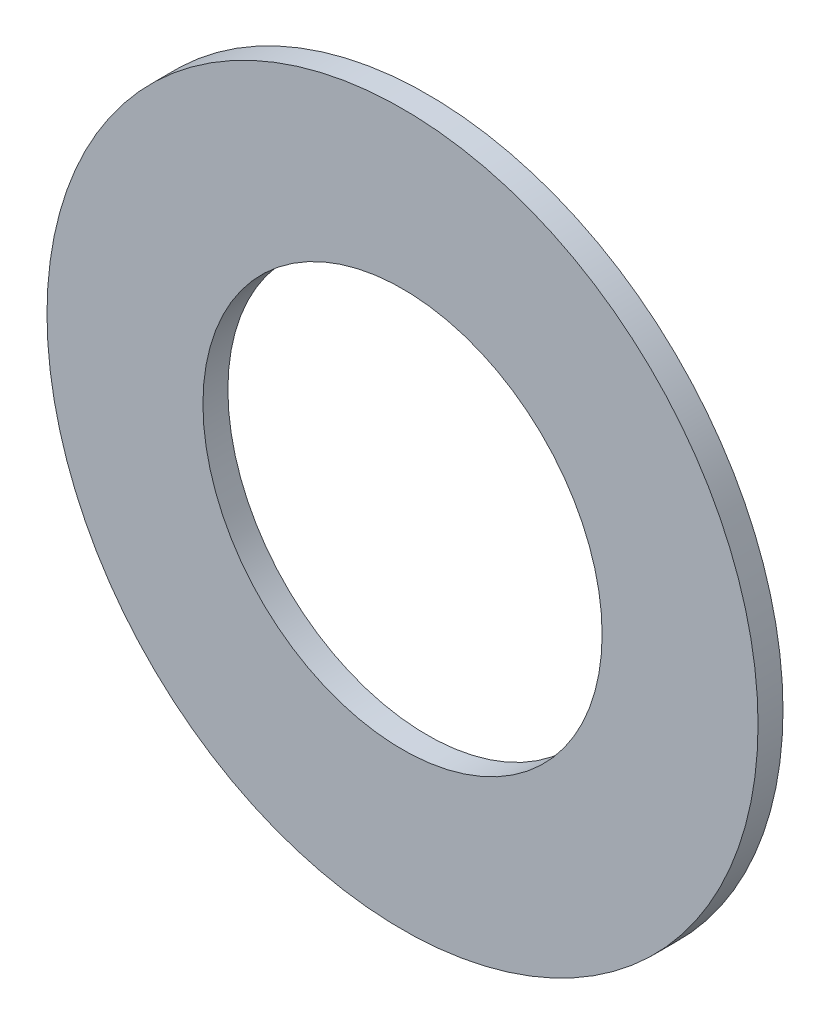
ISO-10303-21;
HEADER;
FILE_DESCRIPTION(('STEP AP214'),'2;1');
FILE_NAME('part.step','',(''),(''),'','','');
FILE_SCHEMA(('AUTOMOTIVE_DESIGN { 1 0 10303 214 1 1 1 1 }'));
ENDSEC;
DATA;
#1=APPLICATION_CONTEXT('core data for automotive mechanical design processes');
#2=APPLICATION_PROTOCOL_DEFINITION('international standard','automotive_design',2000,#1);
#3=PRODUCT_CONTEXT('',#1,'mechanical');
#4=PRODUCT('Part','Part','',(#3));
#5=PRODUCT_RELATED_PRODUCT_CATEGORY('part','',(#4));
#6=PRODUCT_DEFINITION_FORMATION('','',#4);
#7=PRODUCT_DEFINITION_CONTEXT('part definition',#1,'design');
#8=PRODUCT_DEFINITION('design','',#6,#7);
#9=PRODUCT_DEFINITION_SHAPE('','',#8);
#10=(LENGTH_UNIT() NAMED_UNIT(*) SI_UNIT(.MILLI.,.METRE.));
#11=(NAMED_UNIT(*) PLANE_ANGLE_UNIT() SI_UNIT($,.RADIAN.));
#12=(NAMED_UNIT(*) SI_UNIT($,.STERADIAN.) SOLID_ANGLE_UNIT());
#13=UNCERTAINTY_MEASURE_WITH_UNIT(LENGTH_MEASURE(1.E-05),#10,'distance_accuracy_value','');
#14=(GEOMETRIC_REPRESENTATION_CONTEXT(3) GLOBAL_UNCERTAINTY_ASSIGNED_CONTEXT((#13)) GLOBAL_UNIT_ASSIGNED_CONTEXT((#10,
#11,#12)) REPRESENTATION_CONTEXT('',''));
#15=CARTESIAN_POINT('',(0.,0.,0.));
#16=DIRECTION('',(0.,0.,1.));
#17=DIRECTION('',(1.,0.,0.));
#18=AXIS2_PLACEMENT_3D('',#15,#16,#17);
#19=CARTESIAN_POINT('',(0.,0.,-0.508));
#20=DIRECTION('',(0.,0.,1.));
#21=DIRECTION('',(1.,0.,0.));
#22=AXIS2_PLACEMENT_3D('',#19,#20,#21);
#23=CYLINDRICAL_SURFACE('',#22,7.239);
#24=CARTESIAN_POINT('',(0.,0.,-0.508));
#25=DIRECTION('',(0.,0.,1.));
#26=DIRECTION('',(1.,0.,0.));
#27=AXIS2_PLACEMENT_3D('',#24,#25,#26);
#28=CIRCLE('',#27,7.239);
#29=CARTESIAN_POINT('',(7.239,0.,-0.508));
#30=VERTEX_POINT('',#29);
#31=EDGE_CURVE('E10',#30,#30,#28,.T.);
#32=ORIENTED_EDGE('',*,*,#31,.T.);
#33=EDGE_LOOP('',(#32));
#34=FACE_BOUND('',#33,.T.);
#35=CARTESIAN_POINT('',(0.,0.,0.));
#36=DIRECTION('',(0.,0.,1.));
#37=DIRECTION('',(1.,0.,0.));
#38=AXIS2_PLACEMENT_3D('',#35,#36,#37);
#39=CIRCLE('',#38,7.239);
#40=CARTESIAN_POINT('',(7.239,0.,0.));
#41=VERTEX_POINT('',#40);
#42=EDGE_CURVE('E33',#41,#41,#39,.T.);
#43=ORIENTED_EDGE('',*,*,#42,.F.);
#44=EDGE_LOOP('',(#43));
#45=FACE_BOUND('',#44,.T.);
#46=ADVANCED_FACE('F30',(#34,#45),#23,.T.);
#47=CARTESIAN_POINT('',(0.,0.,-0.508));
#48=DIRECTION('',(0.,0.,1.));
#49=DIRECTION('',(1.,0.,0.));
#50=AXIS2_PLACEMENT_3D('',#47,#48,#49);
#51=PLANE('',#50);
#52=CARTESIAN_POINT('',(0.,0.,-0.508));
#53=DIRECTION('',(0.,0.,1.));
#54=DIRECTION('',(1.,0.,0.));
#55=AXIS2_PLACEMENT_3D('',#52,#53,#54);
#56=CIRCLE('',#55,4.064);
#57=CARTESIAN_POINT('',(4.064,0.,-0.508));
#58=VERTEX_POINT('',#57);
#59=EDGE_CURVE('E40',#58,#58,#56,.T.);
#60=ORIENTED_EDGE('',*,*,#59,.T.);
#61=EDGE_LOOP('',(#60));
#62=FACE_BOUND('',#61,.T.);
#63=ORIENTED_EDGE('',*,*,#31,.F.);
#64=EDGE_LOOP('',(#63));
#65=FACE_BOUND('',#64,.T.);
#66=ADVANCED_FACE('F48',(#62,#65),#51,.F.);
#67=CARTESIAN_POINT('',(0.,0.,0.));
#68=DIRECTION('',(0.,0.,1.));
#69=DIRECTION('',(1.,0.,0.));
#70=AXIS2_PLACEMENT_3D('',#67,#68,#69);
#71=PLANE('',#70);
#72=CARTESIAN_POINT('',(0.,0.,0.));
#73=DIRECTION('',(0.,0.,1.));
#74=DIRECTION('',(1.,0.,0.));
#75=AXIS2_PLACEMENT_3D('',#72,#73,#74);
#76=CIRCLE('',#75,4.064);
#77=CARTESIAN_POINT('',(4.064,0.,0.));
#78=VERTEX_POINT('',#77);
#79=EDGE_CURVE('E42',#78,#78,#76,.T.);
#80=ORIENTED_EDGE('',*,*,#79,.F.);
#81=EDGE_LOOP('',(#80));
#82=FACE_BOUND('',#81,.T.);
#83=ORIENTED_EDGE('',*,*,#42,.T.);
#84=EDGE_LOOP('',(#83));
#85=FACE_BOUND('',#84,.T.);
#86=ADVANCED_FACE('F54',(#82,#85),#71,.T.);
#87=CARTESIAN_POINT('',(0.,0.,-0.508));
#88=DIRECTION('',(0.,0.,1.));
#89=DIRECTION('',(1.,0.,0.));
#90=AXIS2_PLACEMENT_3D('',#87,#88,#89);
#91=CYLINDRICAL_SURFACE('',#90,4.064);
#92=ORIENTED_EDGE('',*,*,#59,.F.);
#93=EDGE_LOOP('',(#92));
#94=FACE_BOUND('',#93,.T.);
#95=ORIENTED_EDGE('',*,*,#79,.T.);
#96=EDGE_LOOP('',(#95));
#97=FACE_BOUND('',#96,.T.);
#98=ADVANCED_FACE('F51',(#94,#97),#91,.F.);
#99=CLOSED_SHELL('',(#46,#66,#86,#98));
#100=MANIFOLD_SOLID_BREP('B2',#99);
#101=ADVANCED_BREP_SHAPE_REPRESENTATION('',(#18,#100),#14);
#102=SHAPE_DEFINITION_REPRESENTATION(#9,#101);
ENDSEC;
END-ISO-10303-21;
